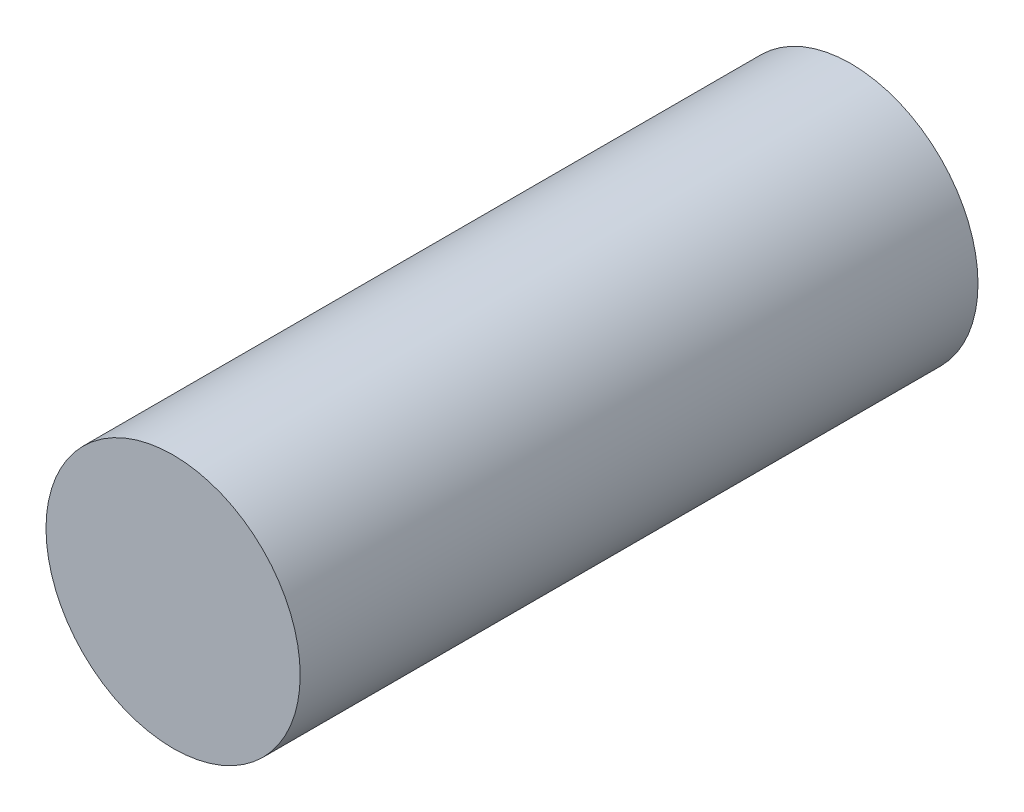
ISO-10303-21;
HEADER;
FILE_DESCRIPTION(('STEP AP214'),'2;1');
FILE_NAME('part.step','',(''),(''),'','','');
FILE_SCHEMA(('AUTOMOTIVE_DESIGN { 1 0 10303 214 1 1 1 1 }'));
ENDSEC;
DATA;
#1=APPLICATION_CONTEXT('core data for automotive mechanical design processes');
#2=APPLICATION_PROTOCOL_DEFINITION('international standard','automotive_design',2000,#1);
#3=PRODUCT_CONTEXT('',#1,'mechanical');
#4=PRODUCT('Part','Part','',(#3));
#5=PRODUCT_RELATED_PRODUCT_CATEGORY('part','',(#4));
#6=PRODUCT_DEFINITION_FORMATION('','',#4);
#7=PRODUCT_DEFINITION_CONTEXT('part definition',#1,'design');
#8=PRODUCT_DEFINITION('design','',#6,#7);
#9=PRODUCT_DEFINITION_SHAPE('','',#8);
#10=(LENGTH_UNIT() NAMED_UNIT(*) SI_UNIT(.MILLI.,.METRE.));
#11=(NAMED_UNIT(*) PLANE_ANGLE_UNIT() SI_UNIT($,.RADIAN.));
#12=(NAMED_UNIT(*) SI_UNIT($,.STERADIAN.) SOLID_ANGLE_UNIT());
#13=UNCERTAINTY_MEASURE_WITH_UNIT(LENGTH_MEASURE(1.E-05),#10,'distance_accuracy_value','');
#14=(GEOMETRIC_REPRESENTATION_CONTEXT(3) GLOBAL_UNCERTAINTY_ASSIGNED_CONTEXT((#13)) GLOBAL_UNIT_ASSIGNED_CONTEXT((#10,
#11,#12)) REPRESENTATION_CONTEXT('',''));
#15=CARTESIAN_POINT('',(0.,0.,0.));
#16=DIRECTION('',(0.,0.,1.));
#17=DIRECTION('',(1.,0.,0.));
#18=AXIS2_PLACEMENT_3D('',#15,#16,#17);
#19=CARTESIAN_POINT('',(-77.17683005113,-21.0650631914314,-10.));
#20=DIRECTION('',(0.,0.,1.));
#21=DIRECTION('',(1.,0.,0.));
#22=AXIS2_PLACEMENT_3D('',#19,#20,#21);
#23=CYLINDRICAL_SURFACE('',#22,3.75000000000001);
#24=CARTESIAN_POINT('',(-77.17683005113,-21.0650631914314,-10.));
#25=DIRECTION('',(0.,0.,1.));
#26=DIRECTION('',(1.,0.,0.));
#27=AXIS2_PLACEMENT_3D('',#24,#25,#26);
#28=CIRCLE('',#27,3.75000000000001);
#29=CARTESIAN_POINT('',(-73.42683005113,-21.0650631914314,-10.));
#30=VERTEX_POINT('',#29);
#31=EDGE_CURVE('E41',#30,#30,#28,.T.);
#32=ORIENTED_EDGE('',*,*,#31,.T.);
#33=EDGE_LOOP('',(#32));
#34=FACE_BOUND('',#33,.T.);
#35=CARTESIAN_POINT('',(-77.17683005113,-21.0650631914314,10.));
#36=DIRECTION('',(0.,0.,1.));
#37=DIRECTION('',(1.,0.,0.));
#38=AXIS2_PLACEMENT_3D('',#35,#36,#37);
#39=CIRCLE('',#38,3.75000000000001);
#40=CARTESIAN_POINT('',(-73.42683005113,-21.0650631914314,10.));
#41=VERTEX_POINT('',#40);
#42=EDGE_CURVE('E10',#41,#41,#39,.T.);
#43=ORIENTED_EDGE('',*,*,#42,.F.);
#44=EDGE_LOOP('',(#43));
#45=FACE_BOUND('',#44,.T.);
#46=ADVANCED_FACE('F34',(#34,#45),#23,.T.);
#47=CARTESIAN_POINT('',(-77.17683005113,-21.0650631914314,-10.));
#48=DIRECTION('',(0.,0.,1.));
#49=DIRECTION('',(1.,0.,0.));
#50=AXIS2_PLACEMENT_3D('',#47,#48,#49);
#51=PLANE('',#50);
#52=ORIENTED_EDGE('',*,*,#31,.F.);
#53=EDGE_LOOP('',(#52));
#54=FACE_BOUND('',#53,.T.);
#55=ADVANCED_FACE('F49',(#54),#51,.F.);
#56=CARTESIAN_POINT('',(-77.17683005113,-21.0650631914314,10.));
#57=DIRECTION('',(0.,0.,1.));
#58=DIRECTION('',(1.,0.,0.));
#59=AXIS2_PLACEMENT_3D('',#56,#57,#58);
#60=PLANE('',#59);
#61=ORIENTED_EDGE('',*,*,#42,.T.);
#62=EDGE_LOOP('',(#61));
#63=FACE_BOUND('',#62,.T.);
#64=ADVANCED_FACE('F36',(#63),#60,.T.);
#65=CLOSED_SHELL('',(#46,#55,#64));
#66=MANIFOLD_SOLID_BREP('B2',#65);
#67=ADVANCED_BREP_SHAPE_REPRESENTATION('',(#18,#66),#14);
#68=SHAPE_DEFINITION_REPRESENTATION(#9,#67);
ENDSEC;
END-ISO-10303-21;
